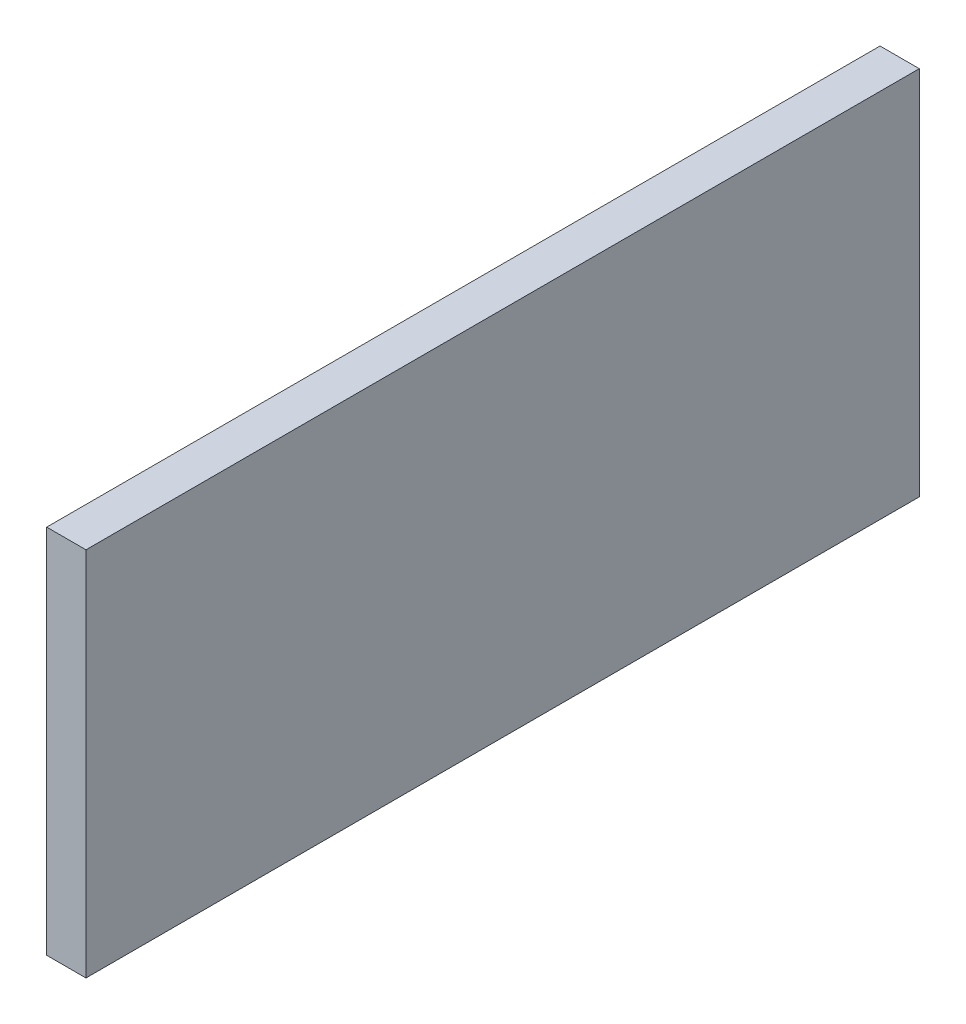
ISO-10303-21;
HEADER;
FILE_DESCRIPTION(('STEP AP214'),'2;1');
FILE_NAME('part.step','',(''),(''),'','','');
FILE_SCHEMA(('AUTOMOTIVE_DESIGN { 1 0 10303 214 1 1 1 1 }'));
ENDSEC;
DATA;
#1=APPLICATION_CONTEXT('core data for automotive mechanical design processes');
#2=APPLICATION_PROTOCOL_DEFINITION('international standard','automotive_design',2000,#1);
#3=PRODUCT_CONTEXT('',#1,'mechanical');
#4=PRODUCT('Part','Part','',(#3));
#5=PRODUCT_RELATED_PRODUCT_CATEGORY('part','',(#4));
#6=PRODUCT_DEFINITION_FORMATION('','',#4);
#7=PRODUCT_DEFINITION_CONTEXT('part definition',#1,'design');
#8=PRODUCT_DEFINITION('design','',#6,#7);
#9=PRODUCT_DEFINITION_SHAPE('','',#8);
#10=(LENGTH_UNIT() NAMED_UNIT(*) SI_UNIT(.MILLI.,.METRE.));
#11=(NAMED_UNIT(*) PLANE_ANGLE_UNIT() SI_UNIT($,.RADIAN.));
#12=(NAMED_UNIT(*) SI_UNIT($,.STERADIAN.) SOLID_ANGLE_UNIT());
#13=UNCERTAINTY_MEASURE_WITH_UNIT(LENGTH_MEASURE(1.E-05),#10,'distance_accuracy_value','');
#14=(GEOMETRIC_REPRESENTATION_CONTEXT(3) GLOBAL_UNCERTAINTY_ASSIGNED_CONTEXT((#13)) GLOBAL_UNIT_ASSIGNED_CONTEXT((#10,
#11,#12)) REPRESENTATION_CONTEXT('',''));
#15=CARTESIAN_POINT('',(0.,0.,0.));
#16=DIRECTION('',(0.,0.,1.));
#17=DIRECTION('',(1.,0.,0.));
#18=AXIS2_PLACEMENT_3D('',#15,#16,#17);
#19=CARTESIAN_POINT('',(18.,-20.1923969871156,-387.489195297468));
#20=DIRECTION('',(0.,0.,1.));
#21=DIRECTION('',(1.,0.,0.));
#22=AXIS2_PLACEMENT_3D('',#19,#20,#21);
#23=PLANE('',#22);
#24=DIRECTION('',(0.,1.,0.));
#25=VECTOR('',#24,1.);
#26=CARTESIAN_POINT('',(0.,-20.1923969871156,-387.489195297468));
#27=LINE('',#26,#25);
#28=CARTESIAN_POINT('',(0.,-20.1923969871156,-387.489195297468));
#29=VERTEX_POINT('',#28);
#30=CARTESIAN_POINT('',(0.,149.807603012884,-387.489195297468));
#31=VERTEX_POINT('',#30);
#32=EDGE_CURVE('E96',#29,#31,#27,.T.);
#33=ORIENTED_EDGE('',*,*,#32,.T.);
#34=DIRECTION('',(-1.,0.,0.));
#35=VECTOR('',#34,1.);
#36=CARTESIAN_POINT('',(18.,149.807603012884,-387.489195297468));
#37=LINE('',#36,#35);
#38=CARTESIAN_POINT('',(18.,149.807603012884,-387.489195297468));
#39=VERTEX_POINT('',#38);
#40=EDGE_CURVE('E11',#39,#31,#37,.T.);
#41=ORIENTED_EDGE('',*,*,#40,.F.);
#42=DIRECTION('',(0.,1.,0.));
#43=VECTOR('',#42,1.);
#44=CARTESIAN_POINT('',(18.,-20.1923969871156,-387.489195297468));
#45=LINE('',#44,#43);
#46=CARTESIAN_POINT('',(18.,-20.1923969871156,-387.489195297468));
#47=VERTEX_POINT('',#46);
#48=EDGE_CURVE('E84',#47,#39,#45,.T.);
#49=ORIENTED_EDGE('',*,*,#48,.F.);
#50=DIRECTION('',(-1.,0.,0.));
#51=VECTOR('',#50,1.);
#52=CARTESIAN_POINT('',(18.,-20.1923969871156,-387.489195297468));
#53=LINE('',#52,#51);
#54=EDGE_CURVE('E92',#47,#29,#53,.T.);
#55=ORIENTED_EDGE('',*,*,#54,.T.);
#56=EDGE_LOOP('',(#33,#41,#49,#55));
#57=FACE_BOUND('',#56,.T.);
#58=ADVANCED_FACE('F33',(#57),#23,.F.);
#59=CARTESIAN_POINT('',(18.,149.807603012884,-387.489195297468));
#60=DIRECTION('',(0.,-1.,0.));
#61=DIRECTION('',(0.,0.,-1.));
#62=AXIS2_PLACEMENT_3D('',#59,#60,#61);
#63=PLANE('',#62);
#64=DIRECTION('',(0.,0.,1.));
#65=VECTOR('',#64,1.);
#66=CARTESIAN_POINT('',(0.,149.807603012884,-387.489195297468));
#67=LINE('',#66,#65);
#68=CARTESIAN_POINT('',(0.,149.807603012884,-5.48919529746833));
#69=VERTEX_POINT('',#68);
#70=EDGE_CURVE('E88',#31,#69,#67,.T.);
#71=ORIENTED_EDGE('',*,*,#70,.T.);
#72=DIRECTION('',(-1.,0.,0.));
#73=VECTOR('',#72,1.);
#74=CARTESIAN_POINT('',(18.,149.807603012884,-5.48919529746833));
#75=LINE('',#74,#73);
#76=CARTESIAN_POINT('',(18.,149.807603012884,-5.48919529746833));
#77=VERTEX_POINT('',#76);
#78=EDGE_CURVE('E41',#77,#69,#75,.T.);
#79=ORIENTED_EDGE('',*,*,#78,.F.);
#80=DIRECTION('',(0.,0.,1.));
#81=VECTOR('',#80,1.);
#82=CARTESIAN_POINT('',(18.,149.807603012884,-387.489195297468));
#83=LINE('',#82,#81);
#84=EDGE_CURVE('E79',#39,#77,#83,.T.);
#85=ORIENTED_EDGE('',*,*,#84,.F.);
#86=ORIENTED_EDGE('',*,*,#40,.T.);
#87=EDGE_LOOP('',(#71,#79,#85,#86));
#88=FACE_BOUND('',#87,.T.);
#89=ADVANCED_FACE('F87',(#88),#63,.F.);
#90=CARTESIAN_POINT('',(18.,-20.1923969871156,-5.48919529746833));
#91=DIRECTION('',(0.,0.,-1.));
#92=DIRECTION('',(-1.,0.,0.));
#93=AXIS2_PLACEMENT_3D('',#90,#91,#92);
#94=PLANE('',#93);
#95=DIRECTION('',(0.,-1.,0.));
#96=VECTOR('',#95,1.);
#97=CARTESIAN_POINT('',(0.,-20.1923969871156,-5.48919529746833));
#98=LINE('',#97,#96);
#99=CARTESIAN_POINT('',(0.,-20.1923969871156,-5.48919529746833));
#100=VERTEX_POINT('',#99);
#101=EDGE_CURVE('E66',#69,#100,#98,.T.);
#102=ORIENTED_EDGE('',*,*,#101,.T.);
#103=DIRECTION('',(-1.,0.,0.));
#104=VECTOR('',#103,1.);
#105=CARTESIAN_POINT('',(18.,-20.1923969871156,-5.48919529746833));
#106=LINE('',#105,#104);
#107=CARTESIAN_POINT('',(18.,-20.1923969871156,-5.48919529746833));
#108=VERTEX_POINT('',#107);
#109=EDGE_CURVE('E89',#108,#100,#106,.T.);
#110=ORIENTED_EDGE('',*,*,#109,.F.);
#111=DIRECTION('',(0.,-1.,0.));
#112=VECTOR('',#111,1.);
#113=CARTESIAN_POINT('',(18.,-20.1923969871156,-5.48919529746833));
#114=LINE('',#113,#112);
#115=EDGE_CURVE('E82',#77,#108,#114,.T.);
#116=ORIENTED_EDGE('',*,*,#115,.F.);
#117=ORIENTED_EDGE('',*,*,#78,.T.);
#118=EDGE_LOOP('',(#102,#110,#116,#117));
#119=FACE_BOUND('',#118,.T.);
#120=ADVANCED_FACE('F90',(#119),#94,.F.);
#121=CARTESIAN_POINT('',(18.,-20.1923969871156,-387.489195297468));
#122=DIRECTION('',(0.,1.,0.));
#123=DIRECTION('',(0.,0.,1.));
#124=AXIS2_PLACEMENT_3D('',#121,#122,#123);
#125=PLANE('',#124);
#126=DIRECTION('',(0.,0.,-1.));
#127=VECTOR('',#126,1.);
#128=CARTESIAN_POINT('',(0.,-20.1923969871156,-387.489195297468));
#129=LINE('',#128,#127);
#130=EDGE_CURVE('E72',#100,#29,#129,.T.);
#131=ORIENTED_EDGE('',*,*,#130,.T.);
#132=ORIENTED_EDGE('',*,*,#54,.F.);
#133=DIRECTION('',(0.,0.,-1.));
#134=VECTOR('',#133,1.);
#135=CARTESIAN_POINT('',(18.,-20.1923969871156,-387.489195297468));
#136=LINE('',#135,#134);
#137=EDGE_CURVE('E49',#108,#47,#136,.T.);
#138=ORIENTED_EDGE('',*,*,#137,.F.);
#139=ORIENTED_EDGE('',*,*,#109,.T.);
#140=EDGE_LOOP('',(#131,#132,#138,#139));
#141=FACE_BOUND('',#140,.T.);
#142=ADVANCED_FACE('F103',(#141),#125,.F.);
#143=CARTESIAN_POINT('',(18.,0.,0.));
#144=DIRECTION('',(1.,0.,0.));
#145=DIRECTION('',(0.,0.,-1.));
#146=AXIS2_PLACEMENT_3D('',#143,#144,#145);
#147=PLANE('',#146);
#148=ORIENTED_EDGE('',*,*,#48,.T.);
#149=ORIENTED_EDGE('',*,*,#84,.T.);
#150=ORIENTED_EDGE('',*,*,#115,.T.);
#151=ORIENTED_EDGE('',*,*,#137,.T.);
#152=EDGE_LOOP('',(#148,#149,#150,#151));
#153=FACE_BOUND('',#152,.T.);
#154=ADVANCED_FACE('F80',(#153),#147,.T.);
#155=CARTESIAN_POINT('',(0.,0.,0.));
#156=DIRECTION('',(1.,0.,0.));
#157=DIRECTION('',(0.,0.,-1.));
#158=AXIS2_PLACEMENT_3D('',#155,#156,#157);
#159=PLANE('',#158);
#160=ORIENTED_EDGE('',*,*,#32,.F.);
#161=ORIENTED_EDGE('',*,*,#130,.F.);
#162=ORIENTED_EDGE('',*,*,#101,.F.);
#163=ORIENTED_EDGE('',*,*,#70,.F.);
#164=EDGE_LOOP('',(#160,#161,#162,#163));
#165=FACE_BOUND('',#164,.T.);
#166=ADVANCED_FACE('F106',(#165),#159,.F.);
#167=CLOSED_SHELL('',(#58,#89,#120,#142,#154,#166));
#168=MANIFOLD_SOLID_BREP('B2',#167);
#169=ADVANCED_BREP_SHAPE_REPRESENTATION('',(#18,#168),#14);
#170=SHAPE_DEFINITION_REPRESENTATION(#9,#169);
ENDSEC;
END-ISO-10303-21;
